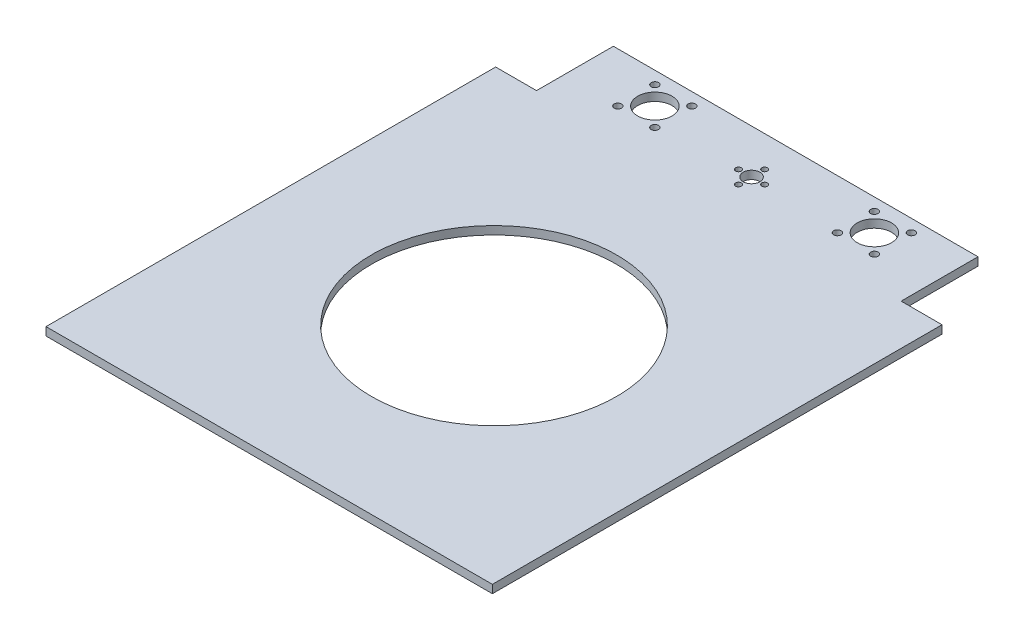
ISO-10303-21;
HEADER;
FILE_DESCRIPTION(('STEP AP214'),'2;1');
FILE_NAME('part.step','',(''),(''),'','','');
FILE_SCHEMA(('AUTOMOTIVE_DESIGN { 1 0 10303 214 1 1 1 1 }'));
ENDSEC;
DATA;
#1=APPLICATION_CONTEXT('core data for automotive mechanical design processes');
#2=APPLICATION_PROTOCOL_DEFINITION('international standard','automotive_design',2000,#1);
#3=PRODUCT_CONTEXT('',#1,'mechanical');
#4=PRODUCT('Part','Part','',(#3));
#5=PRODUCT_RELATED_PRODUCT_CATEGORY('part','',(#4));
#6=PRODUCT_DEFINITION_FORMATION('','',#4);
#7=PRODUCT_DEFINITION_CONTEXT('part definition',#1,'design');
#8=PRODUCT_DEFINITION('design','',#6,#7);
#9=PRODUCT_DEFINITION_SHAPE('','',#8);
#10=(LENGTH_UNIT() NAMED_UNIT(*) SI_UNIT(.MILLI.,.METRE.));
#11=(NAMED_UNIT(*) PLANE_ANGLE_UNIT() SI_UNIT($,.RADIAN.));
#12=(NAMED_UNIT(*) SI_UNIT($,.STERADIAN.) SOLID_ANGLE_UNIT());
#13=UNCERTAINTY_MEASURE_WITH_UNIT(LENGTH_MEASURE(1.E-05),#10,'distance_accuracy_value','');
#14=(GEOMETRIC_REPRESENTATION_CONTEXT(3) GLOBAL_UNCERTAINTY_ASSIGNED_CONTEXT((#13)) GLOBAL_UNIT_ASSIGNED_CONTEXT((#10,
#11,#12)) REPRESENTATION_CONTEXT('',''));
#15=CARTESIAN_POINT('',(0.,0.,0.));
#16=DIRECTION('',(0.,0.,1.));
#17=DIRECTION('',(1.,0.,0.));
#18=AXIS2_PLACEMENT_3D('',#15,#16,#17);
#19=CARTESIAN_POINT('',(0.,5.,0.));
#20=DIRECTION('',(0.,1.,0.));
#21=DIRECTION('',(0.,0.,1.));
#22=AXIS2_PLACEMENT_3D('',#19,#20,#21);
#23=PLANE('',#22);
#24=CARTESIAN_POINT('',(80.6937084989848,5.,-314.313708498985));
#25=DIRECTION('',(0.,1.,0.));
#26=DIRECTION('',(0.,0.,1.));
#27=AXIS2_PLACEMENT_3D('',#24,#25,#26);
#28=CIRCLE('',#27,2.25);
#29=CARTESIAN_POINT('',(80.6937084989848,5.,-312.063708498985));
#30=VERTEX_POINT('',#29);
#31=EDGE_CURVE('E237',#30,#30,#28,.T.);
#32=ORIENTED_EDGE('',*,*,#31,.F.);
#33=EDGE_LOOP('',(#32));
#34=FACE_BOUND('',#33,.T.);
#35=CARTESIAN_POINT('',(69.38,5.,-303.));
#36=DIRECTION('',(0.,1.,0.));
#37=DIRECTION('',(0.,0.,1.));
#38=AXIS2_PLACEMENT_3D('',#35,#36,#37);
#39=CIRCLE('',#38,10.5);
#40=CARTESIAN_POINT('',(69.38,5.,-292.5));
#41=VERTEX_POINT('',#40);
#42=EDGE_CURVE('E230',#41,#41,#39,.T.);
#43=ORIENTED_EDGE('',*,*,#42,.F.);
#44=EDGE_LOOP('',(#43));
#45=FACE_BOUND('',#44,.T.);
#46=CARTESIAN_POINT('',(214.933708498985,5.,-291.686291501015));
#47=DIRECTION('',(0.,-1.,0.));
#48=DIRECTION('',(0.,0.,-1.));
#49=AXIS2_PLACEMENT_3D('',#46,#47,#48);
#50=CIRCLE('',#49,2.25000000000001);
#51=CARTESIAN_POINT('',(214.933708498985,5.,-293.936291501015));
#52=VERTEX_POINT('',#51);
#53=EDGE_CURVE('E242',#52,#52,#50,.T.);
#54=ORIENTED_EDGE('',*,*,#53,.T.);
#55=EDGE_LOOP('',(#54));
#56=FACE_BOUND('',#55,.T.);
#57=CARTESIAN_POINT('',(136.5,5.,-295.));
#58=DIRECTION('',(0.,1.,0.));
#59=DIRECTION('',(0.,0.,1.));
#60=AXIS2_PLACEMENT_3D('',#57,#58,#59);
#61=CIRCLE('',#60,5.09999999999996);
#62=CARTESIAN_POINT('',(136.5,5.,-289.9));
#63=VERTEX_POINT('',#62);
#64=EDGE_CURVE('E217',#63,#63,#61,.T.);
#65=ORIENTED_EDGE('',*,*,#64,.F.);
#66=EDGE_LOOP('',(#65));
#67=FACE_BOUND('',#66,.T.);
#68=CARTESIAN_POINT('',(136.5,5.,-287.));
#69=DIRECTION('',(0.,-1.,0.));
#70=DIRECTION('',(0.,0.,-1.));
#71=AXIS2_PLACEMENT_3D('',#68,#69,#70);
#72=CIRCLE('',#71,1.75000000000033);
#73=CARTESIAN_POINT('',(136.5,5.,-288.75));
#74=VERTEX_POINT('',#73);
#75=EDGE_CURVE('E226',#74,#74,#72,.T.);
#76=ORIENTED_EDGE('',*,*,#75,.T.);
#77=EDGE_LOOP('',(#76));
#78=FACE_BOUND('',#77,.T.);
#79=CARTESIAN_POINT('',(214.933708498985,5.,-314.313708498985));
#80=DIRECTION('',(0.,1.,0.));
#81=DIRECTION('',(0.,0.,1.));
#82=AXIS2_PLACEMENT_3D('',#79,#80,#81);
#83=CIRCLE('',#82,2.25000000000001);
#84=CARTESIAN_POINT('',(214.933708498985,5.,-312.063708498985));
#85=VERTEX_POINT('',#84);
#86=EDGE_CURVE('E266',#85,#85,#83,.T.);
#87=ORIENTED_EDGE('',*,*,#86,.F.);
#88=EDGE_LOOP('',(#87));
#89=FACE_BOUND('',#88,.T.);
#90=CARTESIAN_POINT('',(80.6937084989848,5.,-291.686291501015));
#91=DIRECTION('',(0.,-1.,0.));
#92=DIRECTION('',(0.,0.,-1.));
#93=AXIS2_PLACEMENT_3D('',#90,#91,#92);
#94=CIRCLE('',#93,2.25);
#95=CARTESIAN_POINT('',(80.6937084989848,5.,-293.936291501015));
#96=VERTEX_POINT('',#95);
#97=EDGE_CURVE('E250',#96,#96,#94,.T.);
#98=ORIENTED_EDGE('',*,*,#97,.T.);
#99=EDGE_LOOP('',(#98));
#100=FACE_BOUND('',#99,.T.);
#101=CARTESIAN_POINT('',(58.0662915010152,5.,-291.686291501015));
#102=DIRECTION('',(0.,1.,0.));
#103=DIRECTION('',(0.,0.,1.));
#104=AXIS2_PLACEMENT_3D('',#101,#102,#103);
#105=CIRCLE('',#104,2.25000000000001);
#106=CARTESIAN_POINT('',(58.0662915010152,5.,-289.436291501015));
#107=VERTEX_POINT('',#106);
#108=EDGE_CURVE('E254',#107,#107,#105,.T.);
#109=ORIENTED_EDGE('',*,*,#108,.F.);
#110=EDGE_LOOP('',(#109));
#111=FACE_BOUND('',#110,.T.);
#112=CARTESIAN_POINT('',(192.306291501015,5.,-291.686291501015));
#113=DIRECTION('',(0.,1.,0.));
#114=DIRECTION('',(0.,0.,1.));
#115=AXIS2_PLACEMENT_3D('',#112,#113,#114);
#116=CIRCLE('',#115,2.24999999999998);
#117=CARTESIAN_POINT('',(192.306291501015,5.,-289.436291501015));
#118=VERTEX_POINT('',#117);
#119=EDGE_CURVE('E246',#118,#118,#116,.T.);
#120=ORIENTED_EDGE('',*,*,#119,.F.);
#121=EDGE_LOOP('',(#120));
#122=FACE_BOUND('',#121,.T.);
#123=CARTESIAN_POINT('',(136.5,5.,-137.5));
#124=DIRECTION('',(0.,1.,0.));
#125=DIRECTION('',(0.,0.,1.));
#126=AXIS2_PLACEMENT_3D('',#123,#124,#125);
#127=CIRCLE('',#126,75.);
#128=CARTESIAN_POINT('',(136.5,5.,-62.5));
#129=VERTEX_POINT('',#128);
#130=EDGE_CURVE('E342',#129,#129,#127,.T.);
#131=ORIENTED_EDGE('',*,*,#130,.F.);
#132=EDGE_LOOP('',(#131));
#133=FACE_BOUND('',#132,.T.);
#134=DIRECTION('',(0.,0.,-1.));
#135=VECTOR('',#134,1.);
#136=CARTESIAN_POINT('',(25.,5.,0.));
#137=LINE('',#136,#135);
#138=CARTESIAN_POINT('',(25.,5.,-275.));
#139=VERTEX_POINT('',#138);
#140=CARTESIAN_POINT('',(25.,5.,-322.));
#141=VERTEX_POINT('',#140);
#142=EDGE_CURVE('E200',#139,#141,#137,.T.);
#143=ORIENTED_EDGE('',*,*,#142,.F.);
#144=DIRECTION('',(1.,0.,0.));
#145=VECTOR('',#144,1.);
#146=CARTESIAN_POINT('',(0.,5.,-275.));
#147=LINE('',#146,#145);
#148=CARTESIAN_POINT('',(0.,5.,-275.));
#149=VERTEX_POINT('',#148);
#150=EDGE_CURVE('E191',#149,#139,#147,.T.);
#151=ORIENTED_EDGE('',*,*,#150,.F.);
#152=DIRECTION('',(0.,0.,-1.));
#153=VECTOR('',#152,1.);
#154=CARTESIAN_POINT('',(0.,5.,0.));
#155=LINE('',#154,#153);
#156=CARTESIAN_POINT('',(0.,5.,0.));
#157=VERTEX_POINT('',#156);
#158=EDGE_CURVE('E199',#157,#149,#155,.T.);
#159=ORIENTED_EDGE('',*,*,#158,.F.);
#160=DIRECTION('',(1.,0.,0.));
#161=VECTOR('',#160,1.);
#162=CARTESIAN_POINT('',(0.,5.,0.));
#163=LINE('',#162,#161);
#164=CARTESIAN_POINT('',(273.,5.,0.));
#165=VERTEX_POINT('',#164);
#166=EDGE_CURVE('E193',#157,#165,#163,.T.);
#167=ORIENTED_EDGE('',*,*,#166,.T.);
#168=DIRECTION('',(0.,0.,-1.));
#169=VECTOR('',#168,1.);
#170=CARTESIAN_POINT('',(273.,5.,0.));
#171=LINE('',#170,#169);
#172=CARTESIAN_POINT('',(273.,5.,-275.));
#173=VERTEX_POINT('',#172);
#174=EDGE_CURVE('E187',#165,#173,#171,.T.);
#175=ORIENTED_EDGE('',*,*,#174,.T.);
#176=CARTESIAN_POINT('',(248.,5.,-275.));
#177=VERTEX_POINT('',#176);
#178=EDGE_CURVE('E170',#177,#173,#147,.T.);
#179=ORIENTED_EDGE('',*,*,#178,.F.);
#180=DIRECTION('',(0.,0.,-1.));
#181=VECTOR('',#180,1.);
#182=CARTESIAN_POINT('',(248.,5.,0.));
#183=LINE('',#182,#181);
#184=CARTESIAN_POINT('',(248.,5.,-322.));
#185=VERTEX_POINT('',#184);
#186=EDGE_CURVE('E178',#177,#185,#183,.T.);
#187=ORIENTED_EDGE('',*,*,#186,.T.);
#188=DIRECTION('',(1.,0.,0.));
#189=VECTOR('',#188,1.);
#190=CARTESIAN_POINT('',(0.,5.,-322.));
#191=LINE('',#190,#189);
#192=EDGE_CURVE('E183',#141,#185,#191,.T.);
#193=ORIENTED_EDGE('',*,*,#192,.F.);
#194=EDGE_LOOP('',(#143,#151,#159,#167,#175,#179,#187,#193));
#195=FACE_BOUND('',#194,.T.);
#196=CARTESIAN_POINT('',(136.5,5.,-303.));
#197=DIRECTION('',(0.,1.,0.));
#198=DIRECTION('',(0.,0.,1.));
#199=AXIS2_PLACEMENT_3D('',#196,#197,#198);
#200=CIRCLE('',#199,1.75000000000033);
#201=CARTESIAN_POINT('',(136.5,5.,-301.25));
#202=VERTEX_POINT('',#201);
#203=EDGE_CURVE('E212',#202,#202,#200,.T.);
#204=ORIENTED_EDGE('',*,*,#203,.F.);
#205=EDGE_LOOP('',(#204));
#206=FACE_BOUND('',#205,.T.);
#207=CARTESIAN_POINT('',(203.62,5.,-303.));
#208=DIRECTION('',(0.,-1.,0.));
#209=DIRECTION('',(0.,0.,-1.));
#210=AXIS2_PLACEMENT_3D('',#207,#208,#209);
#211=CIRCLE('',#210,10.5);
#212=CARTESIAN_POINT('',(203.62,5.,-313.5));
#213=VERTEX_POINT('',#212);
#214=EDGE_CURVE('E259',#213,#213,#211,.T.);
#215=ORIENTED_EDGE('',*,*,#214,.T.);
#216=EDGE_LOOP('',(#215));
#217=FACE_BOUND('',#216,.T.);
#218=CARTESIAN_POINT('',(192.306291501015,5.,-314.313708498985));
#219=DIRECTION('',(0.,-1.,0.));
#220=DIRECTION('',(0.,0.,-1.));
#221=AXIS2_PLACEMENT_3D('',#218,#219,#220);
#222=CIRCLE('',#221,2.24999999999998);
#223=CARTESIAN_POINT('',(192.306291501015,5.,-316.563708498985));
#224=VERTEX_POINT('',#223);
#225=EDGE_CURVE('E255',#224,#224,#222,.T.);
#226=ORIENTED_EDGE('',*,*,#225,.T.);
#227=EDGE_LOOP('',(#226));
#228=FACE_BOUND('',#227,.T.);
#229=CARTESIAN_POINT('',(128.5,5.,-295.));
#230=DIRECTION('',(0.,1.,0.));
#231=DIRECTION('',(0.,0.,1.));
#232=AXIS2_PLACEMENT_3D('',#229,#230,#231);
#233=CIRCLE('',#232,1.75000000000033);
#234=CARTESIAN_POINT('',(128.5,5.,-293.25));
#235=VERTEX_POINT('',#234);
#236=EDGE_CURVE('E222',#235,#235,#233,.T.);
#237=ORIENTED_EDGE('',*,*,#236,.F.);
#238=EDGE_LOOP('',(#237));
#239=FACE_BOUND('',#238,.T.);
#240=CARTESIAN_POINT('',(144.5,5.,-295.));
#241=DIRECTION('',(0.,-1.,0.));
#242=DIRECTION('',(0.,0.,-1.));
#243=AXIS2_PLACEMENT_3D('',#240,#241,#242);
#244=CIRCLE('',#243,1.75000000000033);
#245=CARTESIAN_POINT('',(144.5,5.,-296.75));
#246=VERTEX_POINT('',#245);
#247=EDGE_CURVE('E218',#246,#246,#244,.T.);
#248=ORIENTED_EDGE('',*,*,#247,.T.);
#249=EDGE_LOOP('',(#248));
#250=FACE_BOUND('',#249,.T.);
#251=CARTESIAN_POINT('',(58.0662915010152,5.,-314.313708498985));
#252=DIRECTION('',(0.,-1.,0.));
#253=DIRECTION('',(0.,0.,-1.));
#254=AXIS2_PLACEMENT_3D('',#251,#252,#253);
#255=CIRCLE('',#254,2.25000000000001);
#256=CARTESIAN_POINT('',(58.0662915010152,5.,-316.563708498985));
#257=VERTEX_POINT('',#256);
#258=EDGE_CURVE('E241',#257,#257,#255,.T.);
#259=ORIENTED_EDGE('',*,*,#258,.T.);
#260=EDGE_LOOP('',(#259));
#261=FACE_BOUND('',#260,.T.);
#262=ADVANCED_FACE('F95',(#34,#45,#56,#67,#78,#89,#100,#111,#122,#133,#195,#206,#217,#228,#239,
#250,#261),#23,.T.);
#263=CARTESIAN_POINT('',(0.,0.,0.));
#264=DIRECTION('',(0.,1.,0.));
#265=DIRECTION('',(0.,0.,1.));
#266=AXIS2_PLACEMENT_3D('',#263,#264,#265);
#267=PLANE('',#266);
#268=CARTESIAN_POINT('',(80.6937084989848,0.,-314.313708498985));
#269=DIRECTION('',(0.,1.,0.));
#270=DIRECTION('',(0.,0.,1.));
#271=AXIS2_PLACEMENT_3D('',#268,#269,#270);
#272=CIRCLE('',#271,2.25);
#273=CARTESIAN_POINT('',(80.6937084989848,0.,-312.063708498985));
#274=VERTEX_POINT('',#273);
#275=EDGE_CURVE('E99',#274,#274,#272,.T.);
#276=ORIENTED_EDGE('',*,*,#275,.T.);
#277=EDGE_LOOP('',(#276));
#278=FACE_BOUND('',#277,.T.);
#279=CARTESIAN_POINT('',(69.38,0.,-303.));
#280=DIRECTION('',(0.,1.,0.));
#281=DIRECTION('',(0.,0.,1.));
#282=AXIS2_PLACEMENT_3D('',#279,#280,#281);
#283=CIRCLE('',#282,10.5);
#284=CARTESIAN_POINT('',(69.38,0.,-292.5));
#285=VERTEX_POINT('',#284);
#286=EDGE_CURVE('E322',#285,#285,#283,.T.);
#287=ORIENTED_EDGE('',*,*,#286,.T.);
#288=EDGE_LOOP('',(#287));
#289=FACE_BOUND('',#288,.T.);
#290=CARTESIAN_POINT('',(136.5,0.,-295.));
#291=DIRECTION('',(0.,1.,0.));
#292=DIRECTION('',(0.,0.,1.));
#293=AXIS2_PLACEMENT_3D('',#290,#291,#292);
#294=CIRCLE('',#293,5.09999999999996);
#295=CARTESIAN_POINT('',(136.5,0.,-289.9));
#296=VERTEX_POINT('',#295);
#297=EDGE_CURVE('E311',#296,#296,#294,.T.);
#298=ORIENTED_EDGE('',*,*,#297,.T.);
#299=EDGE_LOOP('',(#298));
#300=FACE_BOUND('',#299,.T.);
#301=CARTESIAN_POINT('',(128.5,0.,-295.));
#302=DIRECTION('',(0.,1.,0.));
#303=DIRECTION('',(0.,0.,1.));
#304=AXIS2_PLACEMENT_3D('',#301,#302,#303);
#305=CIRCLE('',#304,1.75000000000033);
#306=CARTESIAN_POINT('',(128.5,0.,-293.25));
#307=VERTEX_POINT('',#306);
#308=EDGE_CURVE('E303',#307,#307,#305,.T.);
#309=ORIENTED_EDGE('',*,*,#308,.T.);
#310=EDGE_LOOP('',(#309));
#311=FACE_BOUND('',#310,.T.);
#312=CARTESIAN_POINT('',(214.933708498985,0.,-314.313708498985));
#313=DIRECTION('',(0.,1.,0.));
#314=DIRECTION('',(0.,0.,1.));
#315=AXIS2_PLACEMENT_3D('',#312,#313,#314);
#316=CIRCLE('',#315,2.25000000000001);
#317=CARTESIAN_POINT('',(214.933708498985,0.,-312.063708498985));
#318=VERTEX_POINT('',#317);
#319=EDGE_CURVE('E287',#318,#318,#316,.T.);
#320=ORIENTED_EDGE('',*,*,#319,.T.);
#321=EDGE_LOOP('',(#320));
#322=FACE_BOUND('',#321,.T.);
#323=CARTESIAN_POINT('',(58.0662915010152,0.,-291.686291501015));
#324=DIRECTION('',(0.,1.,0.));
#325=DIRECTION('',(0.,0.,1.));
#326=AXIS2_PLACEMENT_3D('',#323,#324,#325);
#327=CIRCLE('',#326,2.25000000000001);
#328=CARTESIAN_POINT('',(58.0662915010152,0.,-289.436291501015));
#329=VERTEX_POINT('',#328);
#330=EDGE_CURVE('E296',#329,#329,#327,.T.);
#331=ORIENTED_EDGE('',*,*,#330,.T.);
#332=EDGE_LOOP('',(#331));
#333=FACE_BOUND('',#332,.T.);
#334=CARTESIAN_POINT('',(192.306291501015,0.,-291.686291501015));
#335=DIRECTION('',(0.,1.,0.));
#336=DIRECTION('',(0.,0.,1.));
#337=AXIS2_PLACEMENT_3D('',#334,#335,#336);
#338=CIRCLE('',#337,2.24999999999998);
#339=CARTESIAN_POINT('',(192.306291501015,0.,-289.436291501015));
#340=VERTEX_POINT('',#339);
#341=EDGE_CURVE('E382',#340,#340,#338,.T.);
#342=ORIENTED_EDGE('',*,*,#341,.T.);
#343=EDGE_LOOP('',(#342));
#344=FACE_BOUND('',#343,.T.);
#345=CARTESIAN_POINT('',(136.5,0.,-303.));
#346=DIRECTION('',(0.,1.,0.));
#347=DIRECTION('',(0.,0.,1.));
#348=AXIS2_PLACEMENT_3D('',#345,#346,#347);
#349=CIRCLE('',#348,1.75000000000033);
#350=CARTESIAN_POINT('',(136.5,0.,-301.25));
#351=VERTEX_POINT('',#350);
#352=EDGE_CURVE('E216',#351,#351,#349,.T.);
#353=ORIENTED_EDGE('',*,*,#352,.T.);
#354=EDGE_LOOP('',(#353));
#355=FACE_BOUND('',#354,.T.);
#356=DIRECTION('',(0.,0.,-1.));
#357=VECTOR('',#356,1.);
#358=CARTESIAN_POINT('',(25.,0.,0.));
#359=LINE('',#358,#357);
#360=CARTESIAN_POINT('',(25.,0.,-275.));
#361=VERTEX_POINT('',#360);
#362=CARTESIAN_POINT('',(25.,0.,-322.));
#363=VERTEX_POINT('',#362);
#364=EDGE_CURVE('E329',#361,#363,#359,.T.);
#365=ORIENTED_EDGE('',*,*,#364,.T.);
#366=DIRECTION('',(1.,0.,0.));
#367=VECTOR('',#366,1.);
#368=CARTESIAN_POINT('',(0.,0.,-322.));
#369=LINE('',#368,#367);
#370=CARTESIAN_POINT('',(248.,0.,-322.));
#371=VERTEX_POINT('',#370);
#372=EDGE_CURVE('E209',#363,#371,#369,.T.);
#373=ORIENTED_EDGE('',*,*,#372,.T.);
#374=DIRECTION('',(0.,0.,-1.));
#375=VECTOR('',#374,1.);
#376=CARTESIAN_POINT('',(248.,0.,0.));
#377=LINE('',#376,#375);
#378=CARTESIAN_POINT('',(248.,0.,-275.));
#379=VERTEX_POINT('',#378);
#380=EDGE_CURVE('E355',#379,#371,#377,.T.);
#381=ORIENTED_EDGE('',*,*,#380,.F.);
#382=DIRECTION('',(1.,0.,0.));
#383=VECTOR('',#382,1.);
#384=CARTESIAN_POINT('',(0.,0.,-275.));
#385=LINE('',#384,#383);
#386=CARTESIAN_POINT('',(273.,0.,-275.));
#387=VERTEX_POINT('',#386);
#388=EDGE_CURVE('E172',#379,#387,#385,.T.);
#389=ORIENTED_EDGE('',*,*,#388,.T.);
#390=DIRECTION('',(0.,0.,-1.));
#391=VECTOR('',#390,1.);
#392=CARTESIAN_POINT('',(273.,0.,0.));
#393=LINE('',#392,#391);
#394=CARTESIAN_POINT('',(273.,0.,0.));
#395=VERTEX_POINT('',#394);
#396=EDGE_CURVE('E351',#395,#387,#393,.T.);
#397=ORIENTED_EDGE('',*,*,#396,.F.);
#398=DIRECTION('',(1.,0.,0.));
#399=VECTOR('',#398,1.);
#400=CARTESIAN_POINT('',(0.,0.,0.));
#401=LINE('',#400,#399);
#402=CARTESIAN_POINT('',(0.,0.,0.));
#403=VERTEX_POINT('',#402);
#404=EDGE_CURVE('E348',#403,#395,#401,.T.);
#405=ORIENTED_EDGE('',*,*,#404,.F.);
#406=DIRECTION('',(0.,0.,-1.));
#407=VECTOR('',#406,1.);
#408=CARTESIAN_POINT('',(0.,0.,0.));
#409=LINE('',#408,#407);
#410=CARTESIAN_POINT('',(0.,0.,-275.));
#411=VERTEX_POINT('',#410);
#412=EDGE_CURVE('E339',#403,#411,#409,.T.);
#413=ORIENTED_EDGE('',*,*,#412,.T.);
#414=EDGE_CURVE('E333',#411,#361,#385,.T.);
#415=ORIENTED_EDGE('',*,*,#414,.T.);
#416=EDGE_LOOP('',(#365,#373,#381,#389,#397,#405,#413,#415));
#417=FACE_BOUND('',#416,.T.);
#418=CARTESIAN_POINT('',(136.5,0.,-137.5));
#419=DIRECTION('',(0.,1.,0.));
#420=DIRECTION('',(0.,0.,1.));
#421=AXIS2_PLACEMENT_3D('',#418,#419,#420);
#422=CIRCLE('',#421,75.);
#423=CARTESIAN_POINT('',(136.5,0.,-62.5));
#424=VERTEX_POINT('',#423);
#425=EDGE_CURVE('E206',#424,#424,#422,.T.);
#426=ORIENTED_EDGE('',*,*,#425,.T.);
#427=EDGE_LOOP('',(#426));
#428=FACE_BOUND('',#427,.T.);
#429=CARTESIAN_POINT('',(203.62,0.,-303.));
#430=DIRECTION('',(0.,1.,0.));
#431=DIRECTION('',(0.,0.,1.));
#432=AXIS2_PLACEMENT_3D('',#429,#430,#431);
#433=CIRCLE('',#432,10.5);
#434=CARTESIAN_POINT('',(203.62,0.,-292.5));
#435=VERTEX_POINT('',#434);
#436=EDGE_CURVE('E378',#435,#435,#433,.F.);
#437=ORIENTED_EDGE('',*,*,#436,.F.);
#438=EDGE_LOOP('',(#437));
#439=FACE_BOUND('',#438,.T.);
#440=CARTESIAN_POINT('',(80.6937084989848,0.,-291.686291501015));
#441=DIRECTION('',(0.,1.,0.));
#442=DIRECTION('',(0.,0.,1.));
#443=AXIS2_PLACEMENT_3D('',#440,#441,#442);
#444=CIRCLE('',#443,2.25);
#445=CARTESIAN_POINT('',(80.6937084989848,0.,-289.436291501015));
#446=VERTEX_POINT('',#445);
#447=EDGE_CURVE('E288',#446,#446,#444,.F.);
#448=ORIENTED_EDGE('',*,*,#447,.F.);
#449=EDGE_LOOP('',(#448));
#450=FACE_BOUND('',#449,.T.);
#451=CARTESIAN_POINT('',(192.306291501015,0.,-314.313708498985));
#452=DIRECTION('',(0.,1.,0.));
#453=DIRECTION('',(0.,0.,1.));
#454=AXIS2_PLACEMENT_3D('',#451,#452,#453);
#455=CIRCLE('',#454,2.24999999999998);
#456=CARTESIAN_POINT('',(192.306291501015,0.,-312.063708498985));
#457=VERTEX_POINT('',#456);
#458=EDGE_CURVE('E284',#457,#457,#455,.F.);
#459=ORIENTED_EDGE('',*,*,#458,.F.);
#460=EDGE_LOOP('',(#459));
#461=FACE_BOUND('',#460,.T.);
#462=CARTESIAN_POINT('',(136.5,0.,-287.));
#463=DIRECTION('',(0.,1.,0.));
#464=DIRECTION('',(0.,0.,1.));
#465=AXIS2_PLACEMENT_3D('',#462,#463,#464);
#466=CIRCLE('',#465,1.75000000000033);
#467=CARTESIAN_POINT('',(136.5,0.,-285.25));
#468=VERTEX_POINT('',#467);
#469=EDGE_CURVE('E293',#468,#468,#466,.F.);
#470=ORIENTED_EDGE('',*,*,#469,.F.);
#471=EDGE_LOOP('',(#470));
#472=FACE_BOUND('',#471,.T.);
#473=CARTESIAN_POINT('',(144.5,0.,-295.));
#474=DIRECTION('',(0.,1.,0.));
#475=DIRECTION('',(0.,0.,1.));
#476=AXIS2_PLACEMENT_3D('',#473,#474,#475);
#477=CIRCLE('',#476,1.75000000000033);
#478=CARTESIAN_POINT('',(144.5,0.,-293.25));
#479=VERTEX_POINT('',#478);
#480=EDGE_CURVE('E307',#479,#479,#477,.F.);
#481=ORIENTED_EDGE('',*,*,#480,.F.);
#482=EDGE_LOOP('',(#481));
#483=FACE_BOUND('',#482,.T.);
#484=CARTESIAN_POINT('',(214.933708498985,0.,-291.686291501015));
#485=DIRECTION('',(0.,1.,0.));
#486=DIRECTION('',(0.,0.,1.));
#487=AXIS2_PLACEMENT_3D('',#484,#485,#486);
#488=CIRCLE('',#487,2.25000000000001);
#489=CARTESIAN_POINT('',(214.933708498985,0.,-289.436291501015));
#490=VERTEX_POINT('',#489);
#491=EDGE_CURVE('E315',#490,#490,#488,.F.);
#492=ORIENTED_EDGE('',*,*,#491,.F.);
#493=EDGE_LOOP('',(#492));
#494=FACE_BOUND('',#493,.T.);
#495=CARTESIAN_POINT('',(58.0662915010152,0.,-314.313708498985));
#496=DIRECTION('',(0.,1.,0.));
#497=DIRECTION('',(0.,0.,1.));
#498=AXIS2_PLACEMENT_3D('',#495,#496,#497);
#499=CIRCLE('',#498,2.25000000000001);
#500=CARTESIAN_POINT('',(58.0662915010152,0.,-312.063708498985));
#501=VERTEX_POINT('',#500);
#502=EDGE_CURVE('E319',#501,#501,#499,.F.);
#503=ORIENTED_EDGE('',*,*,#502,.F.);
#504=EDGE_LOOP('',(#503));
#505=FACE_BOUND('',#504,.T.);
#506=ADVANCED_FACE('F389',(#278,#289,#300,#311,#322,#333,#344,#355,#417,#428,#439,#450,#461,
#472,#483,#494,#505),#267,.F.);
#507=CARTESIAN_POINT('',(25.,5.,0.));
#508=DIRECTION('',(-1.,0.,0.));
#509=DIRECTION('',(0.,0.,1.));
#510=AXIS2_PLACEMENT_3D('',#507,#508,#509);
#511=PLANE('',#510);
#512=ORIENTED_EDGE('',*,*,#364,.F.);
#513=DIRECTION('',(0.,-1.,0.));
#514=VECTOR('',#513,1.);
#515=CARTESIAN_POINT('',(25.,5.,-275.));
#516=LINE('',#515,#514);
#517=EDGE_CURVE('E12',#139,#361,#516,.T.);
#518=ORIENTED_EDGE('',*,*,#517,.F.);
#519=ORIENTED_EDGE('',*,*,#142,.T.);
#520=DIRECTION('',(0.,-1.,0.));
#521=VECTOR('',#520,1.);
#522=CARTESIAN_POINT('',(25.,5.,-322.));
#523=LINE('',#522,#521);
#524=EDGE_CURVE('E115',#141,#363,#523,.T.);
#525=ORIENTED_EDGE('',*,*,#524,.T.);
#526=EDGE_LOOP('',(#512,#518,#519,#525));
#527=FACE_BOUND('',#526,.T.);
#528=ADVANCED_FACE('F97',(#527),#511,.T.);
#529=CARTESIAN_POINT('',(0.,5.,-275.));
#530=DIRECTION('',(0.,0.,-1.));
#531=DIRECTION('',(-1.,0.,0.));
#532=AXIS2_PLACEMENT_3D('',#529,#530,#531);
#533=PLANE('',#532);
#534=ORIENTED_EDGE('',*,*,#414,.F.);
#535=DIRECTION('',(0.,-1.,0.));
#536=VECTOR('',#535,1.);
#537=CARTESIAN_POINT('',(0.,5.,-275.));
#538=LINE('',#537,#536);
#539=EDGE_CURVE('E106',#149,#411,#538,.T.);
#540=ORIENTED_EDGE('',*,*,#539,.F.);
#541=ORIENTED_EDGE('',*,*,#150,.T.);
#542=ORIENTED_EDGE('',*,*,#517,.T.);
#543=EDGE_LOOP('',(#534,#540,#541,#542));
#544=FACE_BOUND('',#543,.T.);
#545=ADVANCED_FACE('F431',(#544),#533,.T.);
#546=CARTESIAN_POINT('',(0.,5.,0.));
#547=DIRECTION('',(-1.,0.,0.));
#548=DIRECTION('',(0.,0.,1.));
#549=AXIS2_PLACEMENT_3D('',#546,#547,#548);
#550=PLANE('',#549);
#551=ORIENTED_EDGE('',*,*,#412,.F.);
#552=DIRECTION('',(0.,-1.,0.));
#553=VECTOR('',#552,1.);
#554=CARTESIAN_POINT('',(0.,5.,0.));
#555=LINE('',#554,#553);
#556=EDGE_CURVE('E370',#157,#403,#555,.T.);
#557=ORIENTED_EDGE('',*,*,#556,.F.);
#558=ORIENTED_EDGE('',*,*,#158,.T.);
#559=ORIENTED_EDGE('',*,*,#539,.T.);
#560=EDGE_LOOP('',(#551,#557,#558,#559));
#561=FACE_BOUND('',#560,.T.);
#562=ADVANCED_FACE('F437',(#561),#550,.T.);
#563=CARTESIAN_POINT('',(0.,5.,0.));
#564=DIRECTION('',(0.,0.,-1.));
#565=DIRECTION('',(-1.,0.,0.));
#566=AXIS2_PLACEMENT_3D('',#563,#564,#565);
#567=PLANE('',#566);
#568=ORIENTED_EDGE('',*,*,#404,.T.);
#569=DIRECTION('',(0.,-1.,0.));
#570=VECTOR('',#569,1.);
#571=CARTESIAN_POINT('',(273.,5.,0.));
#572=LINE('',#571,#570);
#573=EDGE_CURVE('E366',#165,#395,#572,.T.);
#574=ORIENTED_EDGE('',*,*,#573,.F.);
#575=ORIENTED_EDGE('',*,*,#166,.F.);
#576=ORIENTED_EDGE('',*,*,#556,.T.);
#577=EDGE_LOOP('',(#568,#574,#575,#576));
#578=FACE_BOUND('',#577,.T.);
#579=ADVANCED_FACE('F434',(#578),#567,.F.);
#580=CARTESIAN_POINT('',(273.,5.,0.));
#581=DIRECTION('',(-1.,0.,0.));
#582=DIRECTION('',(0.,0.,1.));
#583=AXIS2_PLACEMENT_3D('',#580,#581,#582);
#584=PLANE('',#583);
#585=ORIENTED_EDGE('',*,*,#396,.T.);
#586=DIRECTION('',(0.,-1.,0.));
#587=VECTOR('',#586,1.);
#588=CARTESIAN_POINT('',(273.,5.,-275.));
#589=LINE('',#588,#587);
#590=EDGE_CURVE('E176',#173,#387,#589,.T.);
#591=ORIENTED_EDGE('',*,*,#590,.F.);
#592=ORIENTED_EDGE('',*,*,#174,.F.);
#593=ORIENTED_EDGE('',*,*,#573,.T.);
#594=EDGE_LOOP('',(#585,#591,#592,#593));
#595=FACE_BOUND('',#594,.T.);
#596=ADVANCED_FACE('F430',(#595),#584,.F.);
#597=ORIENTED_EDGE('',*,*,#388,.F.);
#598=DIRECTION('',(0.,-1.,0.));
#599=VECTOR('',#598,1.);
#600=CARTESIAN_POINT('',(248.,5.,-275.));
#601=LINE('',#600,#599);
#602=EDGE_CURVE('E166',#177,#379,#601,.T.);
#603=ORIENTED_EDGE('',*,*,#602,.F.);
#604=ORIENTED_EDGE('',*,*,#178,.T.);
#605=ORIENTED_EDGE('',*,*,#590,.T.);
#606=EDGE_LOOP('',(#597,#603,#604,#605));
#607=FACE_BOUND('',#606,.T.);
#608=ADVANCED_FACE('F168',(#607),#533,.T.);
#609=CARTESIAN_POINT('',(248.,5.,0.));
#610=DIRECTION('',(-1.,0.,0.));
#611=DIRECTION('',(0.,0.,1.));
#612=AXIS2_PLACEMENT_3D('',#609,#610,#611);
#613=PLANE('',#612);
#614=ORIENTED_EDGE('',*,*,#380,.T.);
#615=DIRECTION('',(0.,-1.,0.));
#616=VECTOR('',#615,1.);
#617=CARTESIAN_POINT('',(248.,5.,-322.));
#618=LINE('',#617,#616);
#619=EDGE_CURVE('E141',#185,#371,#618,.T.);
#620=ORIENTED_EDGE('',*,*,#619,.F.);
#621=ORIENTED_EDGE('',*,*,#186,.F.);
#622=ORIENTED_EDGE('',*,*,#602,.T.);
#623=EDGE_LOOP('',(#614,#620,#621,#622));
#624=FACE_BOUND('',#623,.T.);
#625=ADVANCED_FACE('F179',(#624),#613,.F.);
#626=CARTESIAN_POINT('',(0.,5.,-322.));
#627=DIRECTION('',(0.,0.,-1.));
#628=DIRECTION('',(-1.,0.,0.));
#629=AXIS2_PLACEMENT_3D('',#626,#627,#628);
#630=PLANE('',#629);
#631=ORIENTED_EDGE('',*,*,#372,.F.);
#632=ORIENTED_EDGE('',*,*,#524,.F.);
#633=ORIENTED_EDGE('',*,*,#192,.T.);
#634=ORIENTED_EDGE('',*,*,#619,.T.);
#635=EDGE_LOOP('',(#631,#632,#633,#634));
#636=FACE_BOUND('',#635,.T.);
#637=ADVANCED_FACE('F422',(#636),#630,.T.);
#638=CARTESIAN_POINT('',(136.5,5.,-137.5));
#639=DIRECTION('',(0.,-1.,0.));
#640=DIRECTION('',(0.,0.,-1.));
#641=AXIS2_PLACEMENT_3D('',#638,#639,#640);
#642=CYLINDRICAL_SURFACE('',#641,75.);
#643=ORIENTED_EDGE('',*,*,#130,.T.);
#644=EDGE_LOOP('',(#643));
#645=FACE_BOUND('',#644,.T.);
#646=ORIENTED_EDGE('',*,*,#425,.F.);
#647=EDGE_LOOP('',(#646));
#648=FACE_BOUND('',#647,.T.);
#649=ADVANCED_FACE('F420',(#645,#648),#642,.F.);
#650=CARTESIAN_POINT('',(136.5,-5.,-303.));
#651=DIRECTION('',(0.,1.,0.));
#652=DIRECTION('',(0.,0.,1.));
#653=AXIS2_PLACEMENT_3D('',#650,#651,#652);
#654=CYLINDRICAL_SURFACE('',#653,1.75000000000033);
#655=ORIENTED_EDGE('',*,*,#203,.T.);
#656=EDGE_LOOP('',(#655));
#657=FACE_BOUND('',#656,.T.);
#658=ORIENTED_EDGE('',*,*,#352,.F.);
#659=EDGE_LOOP('',(#658));
#660=FACE_BOUND('',#659,.T.);
#661=ADVANCED_FACE('F417',(#657,#660),#654,.F.);
#662=CARTESIAN_POINT('',(203.62,-5.,-303.));
#663=DIRECTION('',(0.,1.,0.));
#664=DIRECTION('',(0.,0.,1.));
#665=AXIS2_PLACEMENT_3D('',#662,#663,#664);
#666=CYLINDRICAL_SURFACE('',#665,10.5);
#667=ORIENTED_EDGE('',*,*,#214,.F.);
#668=EDGE_LOOP('',(#667));
#669=FACE_BOUND('',#668,.T.);
#670=ORIENTED_EDGE('',*,*,#436,.T.);
#671=EDGE_LOOP('',(#670));
#672=FACE_BOUND('',#671,.T.);
#673=ADVANCED_FACE('F403',(#669,#672),#666,.F.);
#674=CARTESIAN_POINT('',(192.306291501015,-5.,-291.686291501015));
#675=DIRECTION('',(0.,1.,0.));
#676=DIRECTION('',(0.,0.,1.));
#677=AXIS2_PLACEMENT_3D('',#674,#675,#676);
#678=CYLINDRICAL_SURFACE('',#677,2.24999999999998);
#679=ORIENTED_EDGE('',*,*,#119,.T.);
#680=EDGE_LOOP('',(#679));
#681=FACE_BOUND('',#680,.T.);
#682=ORIENTED_EDGE('',*,*,#341,.F.);
#683=EDGE_LOOP('',(#682));
#684=FACE_BOUND('',#683,.T.);
#685=ADVANCED_FACE('F394',(#681,#684),#678,.F.);
#686=CARTESIAN_POINT('',(58.0662915010152,-5.,-291.686291501015));
#687=DIRECTION('',(0.,1.,0.));
#688=DIRECTION('',(0.,0.,1.));
#689=AXIS2_PLACEMENT_3D('',#686,#687,#688);
#690=CYLINDRICAL_SURFACE('',#689,2.25000000000001);
#691=ORIENTED_EDGE('',*,*,#108,.T.);
#692=EDGE_LOOP('',(#691));
#693=FACE_BOUND('',#692,.T.);
#694=ORIENTED_EDGE('',*,*,#330,.F.);
#695=EDGE_LOOP('',(#694));
#696=FACE_BOUND('',#695,.T.);
#697=ADVANCED_FACE('F392',(#693,#696),#690,.F.);
#698=CARTESIAN_POINT('',(80.6937084989848,-5.,-291.686291501015));
#699=DIRECTION('',(0.,1.,0.));
#700=DIRECTION('',(0.,0.,1.));
#701=AXIS2_PLACEMENT_3D('',#698,#699,#700);
#702=CYLINDRICAL_SURFACE('',#701,2.25);
#703=ORIENTED_EDGE('',*,*,#97,.F.);
#704=EDGE_LOOP('',(#703));
#705=FACE_BOUND('',#704,.T.);
#706=ORIENTED_EDGE('',*,*,#447,.T.);
#707=EDGE_LOOP('',(#706));
#708=FACE_BOUND('',#707,.T.);
#709=ADVANCED_FACE('F280',(#705,#708),#702,.F.);
#710=CARTESIAN_POINT('',(192.306291501015,-5.,-314.313708498985));
#711=DIRECTION('',(0.,1.,0.));
#712=DIRECTION('',(0.,0.,1.));
#713=AXIS2_PLACEMENT_3D('',#710,#711,#712);
#714=CYLINDRICAL_SURFACE('',#713,2.24999999999998);
#715=ORIENTED_EDGE('',*,*,#225,.F.);
#716=EDGE_LOOP('',(#715));
#717=FACE_BOUND('',#716,.T.);
#718=ORIENTED_EDGE('',*,*,#458,.T.);
#719=EDGE_LOOP('',(#718));
#720=FACE_BOUND('',#719,.T.);
#721=ADVANCED_FACE('F276',(#717,#720),#714,.F.);
#722=CARTESIAN_POINT('',(214.933708498985,-5.,-314.313708498985));
#723=DIRECTION('',(0.,1.,0.));
#724=DIRECTION('',(0.,0.,1.));
#725=AXIS2_PLACEMENT_3D('',#722,#723,#724);
#726=CYLINDRICAL_SURFACE('',#725,2.25000000000001);
#727=ORIENTED_EDGE('',*,*,#86,.T.);
#728=EDGE_LOOP('',(#727));
#729=FACE_BOUND('',#728,.T.);
#730=ORIENTED_EDGE('',*,*,#319,.F.);
#731=EDGE_LOOP('',(#730));
#732=FACE_BOUND('',#731,.T.);
#733=ADVANCED_FACE('F279',(#729,#732),#726,.F.);
#734=CARTESIAN_POINT('',(136.5,-5.,-287.));
#735=DIRECTION('',(0.,1.,0.));
#736=DIRECTION('',(0.,0.,1.));
#737=AXIS2_PLACEMENT_3D('',#734,#735,#736);
#738=CYLINDRICAL_SURFACE('',#737,1.75000000000033);
#739=ORIENTED_EDGE('',*,*,#75,.F.);
#740=EDGE_LOOP('',(#739));
#741=FACE_BOUND('',#740,.T.);
#742=ORIENTED_EDGE('',*,*,#469,.T.);
#743=EDGE_LOOP('',(#742));
#744=FACE_BOUND('',#743,.T.);
#745=ADVANCED_FACE('F500',(#741,#744),#738,.F.);
#746=CARTESIAN_POINT('',(128.5,-5.,-295.));
#747=DIRECTION('',(0.,1.,0.));
#748=DIRECTION('',(0.,0.,1.));
#749=AXIS2_PLACEMENT_3D('',#746,#747,#748);
#750=CYLINDRICAL_SURFACE('',#749,1.75000000000033);
#751=ORIENTED_EDGE('',*,*,#236,.T.);
#752=EDGE_LOOP('',(#751));
#753=FACE_BOUND('',#752,.T.);
#754=ORIENTED_EDGE('',*,*,#308,.F.);
#755=EDGE_LOOP('',(#754));
#756=FACE_BOUND('',#755,.T.);
#757=ADVANCED_FACE('F496',(#753,#756),#750,.F.);
#758=CARTESIAN_POINT('',(144.5,-5.,-295.));
#759=DIRECTION('',(0.,1.,0.));
#760=DIRECTION('',(0.,0.,1.));
#761=AXIS2_PLACEMENT_3D('',#758,#759,#760);
#762=CYLINDRICAL_SURFACE('',#761,1.75000000000033);
#763=ORIENTED_EDGE('',*,*,#247,.F.);
#764=EDGE_LOOP('',(#763));
#765=FACE_BOUND('',#764,.T.);
#766=ORIENTED_EDGE('',*,*,#480,.T.);
#767=EDGE_LOOP('',(#766));
#768=FACE_BOUND('',#767,.T.);
#769=ADVANCED_FACE('F499',(#765,#768),#762,.F.);
#770=CARTESIAN_POINT('',(136.5,-5.,-295.));
#771=DIRECTION('',(0.,1.,0.));
#772=DIRECTION('',(0.,0.,1.));
#773=AXIS2_PLACEMENT_3D('',#770,#771,#772);
#774=CYLINDRICAL_SURFACE('',#773,5.09999999999996);
#775=ORIENTED_EDGE('',*,*,#64,.T.);
#776=EDGE_LOOP('',(#775));
#777=FACE_BOUND('',#776,.T.);
#778=ORIENTED_EDGE('',*,*,#297,.F.);
#779=EDGE_LOOP('',(#778));
#780=FACE_BOUND('',#779,.T.);
#781=ADVANCED_FACE('F488',(#777,#780),#774,.F.);
#782=CARTESIAN_POINT('',(214.933708498985,-5.,-291.686291501015));
#783=DIRECTION('',(0.,1.,0.));
#784=DIRECTION('',(0.,0.,1.));
#785=AXIS2_PLACEMENT_3D('',#782,#783,#784);
#786=CYLINDRICAL_SURFACE('',#785,2.25000000000001);
#787=ORIENTED_EDGE('',*,*,#53,.F.);
#788=EDGE_LOOP('',(#787));
#789=FACE_BOUND('',#788,.T.);
#790=ORIENTED_EDGE('',*,*,#491,.T.);
#791=EDGE_LOOP('',(#790));
#792=FACE_BOUND('',#791,.T.);
#793=ADVANCED_FACE('F478',(#789,#792),#786,.F.);
#794=CARTESIAN_POINT('',(58.0662915010152,-5.,-314.313708498985));
#795=DIRECTION('',(0.,1.,0.));
#796=DIRECTION('',(0.,0.,1.));
#797=AXIS2_PLACEMENT_3D('',#794,#795,#796);
#798=CYLINDRICAL_SURFACE('',#797,2.25000000000001);
#799=ORIENTED_EDGE('',*,*,#258,.F.);
#800=EDGE_LOOP('',(#799));
#801=FACE_BOUND('',#800,.T.);
#802=ORIENTED_EDGE('',*,*,#502,.T.);
#803=EDGE_LOOP('',(#802));
#804=FACE_BOUND('',#803,.T.);
#805=ADVANCED_FACE('F475',(#801,#804),#798,.F.);
#806=CARTESIAN_POINT('',(69.38,-5.,-303.));
#807=DIRECTION('',(0.,1.,0.));
#808=DIRECTION('',(0.,0.,1.));
#809=AXIS2_PLACEMENT_3D('',#806,#807,#808);
#810=CYLINDRICAL_SURFACE('',#809,10.5);
#811=ORIENTED_EDGE('',*,*,#42,.T.);
#812=EDGE_LOOP('',(#811));
#813=FACE_BOUND('',#812,.T.);
#814=ORIENTED_EDGE('',*,*,#286,.F.);
#815=EDGE_LOOP('',(#814));
#816=FACE_BOUND('',#815,.T.);
#817=ADVANCED_FACE('F477',(#813,#816),#810,.F.);
#818=CARTESIAN_POINT('',(80.6937084989848,-5.,-314.313708498985));
#819=DIRECTION('',(0.,1.,0.));
#820=DIRECTION('',(0.,0.,1.));
#821=AXIS2_PLACEMENT_3D('',#818,#819,#820);
#822=CYLINDRICAL_SURFACE('',#821,2.25);
#823=ORIENTED_EDGE('',*,*,#31,.T.);
#824=EDGE_LOOP('',(#823));
#825=FACE_BOUND('',#824,.T.);
#826=ORIENTED_EDGE('',*,*,#275,.F.);
#827=EDGE_LOOP('',(#826));
#828=FACE_BOUND('',#827,.T.);
#829=ADVANCED_FACE('F485',(#825,#828),#822,.F.);
#830=CLOSED_SHELL('',(#262,#506,#528,#545,#562,#579,#596,#608,#625,#637,#649,#661,#673,#685,
#697,#709,#721,#733,#745,#757,#769,#781,#793,#805,#817,#829));
#831=MANIFOLD_SOLID_BREP('B2',#830);
#832=ADVANCED_BREP_SHAPE_REPRESENTATION('',(#18,#831),#14);
#833=SHAPE_DEFINITION_REPRESENTATION(#9,#832);
ENDSEC;
END-ISO-10303-21;
